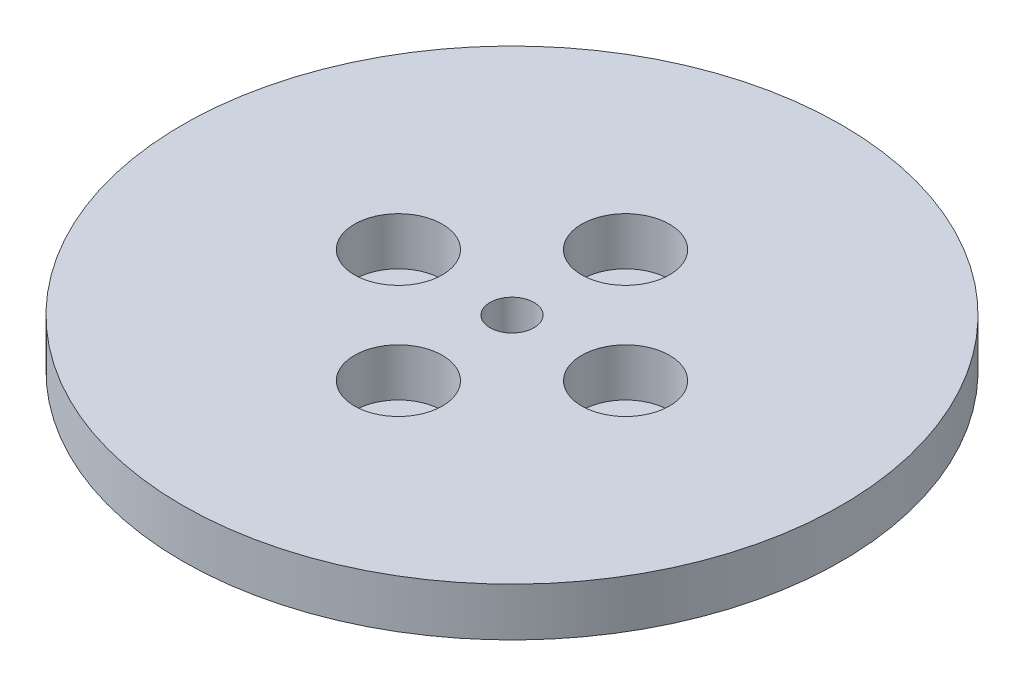
ISO-10303-21;
HEADER;
FILE_DESCRIPTION(('STEP AP214'),'2;1');
FILE_NAME('part.step','',(''),(''),'','','');
FILE_SCHEMA(('AUTOMOTIVE_DESIGN { 1 0 10303 214 1 1 1 1 }'));
ENDSEC;
DATA;
#1=APPLICATION_CONTEXT('core data for automotive mechanical design processes');
#2=APPLICATION_PROTOCOL_DEFINITION('international standard','automotive_design',2000,#1);
#3=PRODUCT_CONTEXT('',#1,'mechanical');
#4=PRODUCT('Part','Part','',(#3));
#5=PRODUCT_RELATED_PRODUCT_CATEGORY('part','',(#4));
#6=PRODUCT_DEFINITION_FORMATION('','',#4);
#7=PRODUCT_DEFINITION_CONTEXT('part definition',#1,'design');
#8=PRODUCT_DEFINITION('design','',#6,#7);
#9=PRODUCT_DEFINITION_SHAPE('','',#8);
#10=(LENGTH_UNIT() NAMED_UNIT(*) SI_UNIT(.MILLI.,.METRE.));
#11=(NAMED_UNIT(*) PLANE_ANGLE_UNIT() SI_UNIT($,.RADIAN.));
#12=(NAMED_UNIT(*) SI_UNIT($,.STERADIAN.) SOLID_ANGLE_UNIT());
#13=UNCERTAINTY_MEASURE_WITH_UNIT(LENGTH_MEASURE(1.E-05),#10,'distance_accuracy_value','');
#14=(GEOMETRIC_REPRESENTATION_CONTEXT(3) GLOBAL_UNCERTAINTY_ASSIGNED_CONTEXT((#13)) GLOBAL_UNIT_ASSIGNED_CONTEXT((#10,
#11,#12)) REPRESENTATION_CONTEXT('',''));
#15=CARTESIAN_POINT('',(0.,0.,0.));
#16=DIRECTION('',(0.,0.,1.));
#17=DIRECTION('',(1.,0.,0.));
#18=AXIS2_PLACEMENT_3D('',#15,#16,#17);
#19=CARTESIAN_POINT('',(0.,11.,0.));
#20=DIRECTION('',(0.,-1.,0.));
#21=DIRECTION('',(0.,0.,-1.));
#22=AXIS2_PLACEMENT_3D('',#19,#20,#21);
#23=CYLINDRICAL_SURFACE('',#22,75.);
#24=CARTESIAN_POINT('',(0.,11.,0.));
#25=DIRECTION('',(0.,1.,0.));
#26=DIRECTION('',(0.,0.,1.));
#27=AXIS2_PLACEMENT_3D('',#24,#25,#26);
#28=CIRCLE('',#27,75.);
#29=CARTESIAN_POINT('',(0.,11.,75.));
#30=VERTEX_POINT('',#29);
#31=EDGE_CURVE('E10',#30,#30,#28,.T.);
#32=ORIENTED_EDGE('',*,*,#31,.F.);
#33=EDGE_LOOP('',(#32));
#34=FACE_BOUND('',#33,.T.);
#35=CARTESIAN_POINT('',(0.,0.,0.));
#36=DIRECTION('',(0.,1.,0.));
#37=DIRECTION('',(0.,0.,1.));
#38=AXIS2_PLACEMENT_3D('',#35,#36,#37);
#39=CIRCLE('',#38,75.);
#40=CARTESIAN_POINT('',(0.,0.,75.));
#41=VERTEX_POINT('',#40);
#42=EDGE_CURVE('E37',#41,#41,#39,.T.);
#43=ORIENTED_EDGE('',*,*,#42,.T.);
#44=EDGE_LOOP('',(#43));
#45=FACE_BOUND('',#44,.T.);
#46=ADVANCED_FACE('F40',(#34,#45),#23,.T.);
#47=CARTESIAN_POINT('',(0.,11.,0.));
#48=DIRECTION('',(0.,1.,0.));
#49=DIRECTION('',(0.,0.,1.));
#50=AXIS2_PLACEMENT_3D('',#47,#48,#49);
#51=PLANE('',#50);
#52=CARTESIAN_POINT('',(0.,11.,25.8487012314361));
#53=DIRECTION('',(0.,1.,0.));
#54=DIRECTION('',(1.,0.,0.));
#55=AXIS2_PLACEMENT_3D('',#52,#53,#54);
#56=CIRCLE('',#55,10.);
#57=CARTESIAN_POINT('',(10.0000000000001,11.,25.848701231436));
#58=VERTEX_POINT('',#57);
#59=EDGE_CURVE('E71',#58,#58,#56,.T.);
#60=ORIENTED_EDGE('',*,*,#59,.F.);
#61=EDGE_LOOP('',(#60));
#62=FACE_BOUND('',#61,.T.);
#63=CARTESIAN_POINT('',(25.8487012314361,11.,0.));
#64=DIRECTION('',(0.,1.,0.));
#65=DIRECTION('',(0.,0.,-1.));
#66=AXIS2_PLACEMENT_3D('',#63,#64,#65);
#67=CIRCLE('',#66,10.);
#68=CARTESIAN_POINT('',(25.8487012314361,11.,-10.));
#69=VERTEX_POINT('',#68);
#70=EDGE_CURVE('E70',#69,#69,#67,.T.);
#71=ORIENTED_EDGE('',*,*,#70,.F.);
#72=EDGE_LOOP('',(#71));
#73=FACE_BOUND('',#72,.T.);
#74=CARTESIAN_POINT('',(-2.70750773948672E-13,11.,-25.8487012314361));
#75=DIRECTION('',(0.,1.,0.));
#76=DIRECTION('',(-1.,0.,0.));
#77=AXIS2_PLACEMENT_3D('',#74,#75,#76);
#78=CIRCLE('',#77,10.);
#79=CARTESIAN_POINT('',(-10.0000000000003,11.,-25.848701231436));
#80=VERTEX_POINT('',#79);
#81=EDGE_CURVE('E61',#80,#80,#78,.T.);
#82=ORIENTED_EDGE('',*,*,#81,.F.);
#83=EDGE_LOOP('',(#82));
#84=FACE_BOUND('',#83,.T.);
#85=CARTESIAN_POINT('',(-25.8487012314361,11.,0.));
#86=DIRECTION('',(0.,1.,0.));
#87=DIRECTION('',(0.,0.,1.));
#88=AXIS2_PLACEMENT_3D('',#85,#86,#87);
#89=CIRCLE('',#88,10.);
#90=CARTESIAN_POINT('',(-25.8487012314361,11.,10.));
#91=VERTEX_POINT('',#90);
#92=EDGE_CURVE('E54',#91,#91,#89,.T.);
#93=ORIENTED_EDGE('',*,*,#92,.F.);
#94=EDGE_LOOP('',(#93));
#95=FACE_BOUND('',#94,.T.);
#96=CARTESIAN_POINT('',(0.,11.,0.));
#97=DIRECTION('',(0.,1.,0.));
#98=DIRECTION('',(0.,0.,1.));
#99=AXIS2_PLACEMENT_3D('',#96,#97,#98);
#100=CIRCLE('',#99,5.);
#101=CARTESIAN_POINT('',(0.,11.,5.));
#102=VERTEX_POINT('',#101);
#103=EDGE_CURVE('E50',#102,#102,#100,.T.);
#104=ORIENTED_EDGE('',*,*,#103,.F.);
#105=EDGE_LOOP('',(#104));
#106=FACE_BOUND('',#105,.T.);
#107=ORIENTED_EDGE('',*,*,#31,.T.);
#108=EDGE_LOOP('',(#107));
#109=FACE_BOUND('',#108,.T.);
#110=ADVANCED_FACE('F86',(#62,#73,#84,#95,#106,#109),#51,.T.);
#111=CARTESIAN_POINT('',(0.,0.,0.));
#112=DIRECTION('',(0.,1.,0.));
#113=DIRECTION('',(0.,0.,1.));
#114=AXIS2_PLACEMENT_3D('',#111,#112,#113);
#115=PLANE('',#114);
#116=CARTESIAN_POINT('',(0.,0.,0.));
#117=DIRECTION('',(0.,1.,0.));
#118=DIRECTION('',(0.,0.,1.));
#119=AXIS2_PLACEMENT_3D('',#116,#117,#118);
#120=CIRCLE('',#119,5.);
#121=CARTESIAN_POINT('',(0.,0.,5.));
#122=VERTEX_POINT('',#121);
#123=EDGE_CURVE('E47',#122,#122,#120,.T.);
#124=ORIENTED_EDGE('',*,*,#123,.T.);
#125=EDGE_LOOP('',(#124));
#126=FACE_BOUND('',#125,.T.);
#127=ORIENTED_EDGE('',*,*,#42,.F.);
#128=EDGE_LOOP('',(#127));
#129=FACE_BOUND('',#128,.T.);
#130=ADVANCED_FACE('F93',(#126,#129),#115,.F.);
#131=CARTESIAN_POINT('',(0.,11.,0.));
#132=DIRECTION('',(0.,-1.,0.));
#133=DIRECTION('',(0.,0.,-1.));
#134=AXIS2_PLACEMENT_3D('',#131,#132,#133);
#135=CYLINDRICAL_SURFACE('',#134,5.);
#136=ORIENTED_EDGE('',*,*,#103,.T.);
#137=EDGE_LOOP('',(#136));
#138=FACE_BOUND('',#137,.T.);
#139=ORIENTED_EDGE('',*,*,#123,.F.);
#140=EDGE_LOOP('',(#139));
#141=FACE_BOUND('',#140,.T.);
#142=ADVANCED_FACE('F101',(#138,#141),#135,.F.);
#143=CARTESIAN_POINT('',(-25.8487012314361,0.126823534459064,0.));
#144=DIRECTION('',(0.,1.,0.));
#145=DIRECTION('',(0.,0.,1.));
#146=AXIS2_PLACEMENT_3D('',#143,#144,#145);
#147=CYLINDRICAL_SURFACE('',#146,10.);
#148=CARTESIAN_POINT('',(-25.8487012314361,0.126823534459064,0.));
#149=DIRECTION('',(0.,1.,0.));
#150=DIRECTION('',(0.,0.,1.));
#151=AXIS2_PLACEMENT_3D('',#148,#149,#150);
#152=CIRCLE('',#151,10.);
#153=CARTESIAN_POINT('',(-25.8487012314361,0.126823534459064,10.));
#154=VERTEX_POINT('',#153);
#155=EDGE_CURVE('E55',#154,#154,#152,.T.);
#156=ORIENTED_EDGE('',*,*,#155,.F.);
#157=EDGE_LOOP('',(#156));
#158=FACE_BOUND('',#157,.T.);
#159=ORIENTED_EDGE('',*,*,#92,.T.);
#160=EDGE_LOOP('',(#159));
#161=FACE_BOUND('',#160,.T.);
#162=ADVANCED_FACE('F102',(#158,#161),#147,.F.);
#163=CARTESIAN_POINT('',(-25.8487012314361,0.126823534459064,0.));
#164=DIRECTION('',(0.,1.,0.));
#165=DIRECTION('',(0.,0.,1.));
#166=AXIS2_PLACEMENT_3D('',#163,#164,#165);
#167=PLANE('',#166);
#168=ORIENTED_EDGE('',*,*,#155,.T.);
#169=EDGE_LOOP('',(#168));
#170=FACE_BOUND('',#169,.T.);
#171=ADVANCED_FACE('F133',(#170),#167,.T.);
#172=CARTESIAN_POINT('',(-2.70750773948672E-13,0.126823534459064,-25.8487012314361));
#173=DIRECTION('',(0.,1.,0.));
#174=DIRECTION('',(0.,0.,1.));
#175=AXIS2_PLACEMENT_3D('',#172,#173,#174);
#176=CYLINDRICAL_SURFACE('',#175,10.);
#177=CARTESIAN_POINT('',(-2.70750773948672E-13,0.126823534459064,-25.8487012314361));
#178=DIRECTION('',(0.,1.,0.));
#179=DIRECTION('',(-1.,0.,0.));
#180=AXIS2_PLACEMENT_3D('',#177,#178,#179);
#181=CIRCLE('',#180,10.);
#182=CARTESIAN_POINT('',(-10.0000000000003,0.126823534459064,-25.848701231436));
#183=VERTEX_POINT('',#182);
#184=EDGE_CURVE('E63',#183,#183,#181,.T.);
#185=ORIENTED_EDGE('',*,*,#184,.F.);
#186=EDGE_LOOP('',(#185));
#187=FACE_BOUND('',#186,.T.);
#188=ORIENTED_EDGE('',*,*,#81,.T.);
#189=EDGE_LOOP('',(#188));
#190=FACE_BOUND('',#189,.T.);
#191=ADVANCED_FACE('F142',(#187,#190),#176,.F.);
#192=CARTESIAN_POINT('',(-2.70750773948672E-13,0.126823534459064,-25.8487012314361));
#193=DIRECTION('',(0.,1.,0.));
#194=DIRECTION('',(-1.,0.,0.));
#195=AXIS2_PLACEMENT_3D('',#192,#193,#194);
#196=PLANE('',#195);
#197=ORIENTED_EDGE('',*,*,#184,.T.);
#198=EDGE_LOOP('',(#197));
#199=FACE_BOUND('',#198,.T.);
#200=ADVANCED_FACE('F156',(#199),#196,.T.);
#201=CARTESIAN_POINT('',(25.8487012314361,0.126823534459064,0.));
#202=DIRECTION('',(0.,1.,0.));
#203=DIRECTION('',(0.,0.,1.));
#204=AXIS2_PLACEMENT_3D('',#201,#202,#203);
#205=CYLINDRICAL_SURFACE('',#204,10.);
#206=CARTESIAN_POINT('',(25.8487012314361,0.126823534459064,0.));
#207=DIRECTION('',(0.,1.,0.));
#208=DIRECTION('',(0.,0.,-1.));
#209=AXIS2_PLACEMENT_3D('',#206,#207,#208);
#210=CIRCLE('',#209,10.);
#211=CARTESIAN_POINT('',(25.8487012314361,0.126823534459064,-10.));
#212=VERTEX_POINT('',#211);
#213=EDGE_CURVE('E69',#212,#212,#210,.T.);
#214=ORIENTED_EDGE('',*,*,#213,.F.);
#215=EDGE_LOOP('',(#214));
#216=FACE_BOUND('',#215,.T.);
#217=ORIENTED_EDGE('',*,*,#70,.T.);
#218=EDGE_LOOP('',(#217));
#219=FACE_BOUND('',#218,.T.);
#220=ADVANCED_FACE('F164',(#216,#219),#205,.F.);
#221=CARTESIAN_POINT('',(25.8487012314361,0.126823534459064,0.));
#222=DIRECTION('',(0.,1.,0.));
#223=DIRECTION('',(0.,0.,-1.));
#224=AXIS2_PLACEMENT_3D('',#221,#222,#223);
#225=PLANE('',#224);
#226=ORIENTED_EDGE('',*,*,#213,.T.);
#227=EDGE_LOOP('',(#226));
#228=FACE_BOUND('',#227,.T.);
#229=ADVANCED_FACE('F83',(#228),#225,.T.);
#230=CARTESIAN_POINT('',(0.,0.126823534459064,25.8487012314361));
#231=DIRECTION('',(0.,1.,0.));
#232=DIRECTION('',(0.,0.,1.));
#233=AXIS2_PLACEMENT_3D('',#230,#231,#232);
#234=CYLINDRICAL_SURFACE('',#233,10.);
#235=CARTESIAN_POINT('',(0.,0.126823534459064,25.8487012314361));
#236=DIRECTION('',(0.,1.,0.));
#237=DIRECTION('',(1.,0.,0.));
#238=AXIS2_PLACEMENT_3D('',#235,#236,#237);
#239=CIRCLE('',#238,10.);
#240=CARTESIAN_POINT('',(10.0000000000001,0.126823534459064,25.848701231436));
#241=VERTEX_POINT('',#240);
#242=EDGE_CURVE('E59',#241,#241,#239,.T.);
#243=ORIENTED_EDGE('',*,*,#242,.F.);
#244=EDGE_LOOP('',(#243));
#245=FACE_BOUND('',#244,.T.);
#246=ORIENTED_EDGE('',*,*,#59,.T.);
#247=EDGE_LOOP('',(#246));
#248=FACE_BOUND('',#247,.T.);
#249=ADVANCED_FACE('F81',(#245,#248),#234,.F.);
#250=CARTESIAN_POINT('',(0.,0.126823534459064,25.8487012314361));
#251=DIRECTION('',(0.,1.,0.));
#252=DIRECTION('',(1.,0.,0.));
#253=AXIS2_PLACEMENT_3D('',#250,#251,#252);
#254=PLANE('',#253);
#255=ORIENTED_EDGE('',*,*,#242,.T.);
#256=EDGE_LOOP('',(#255));
#257=FACE_BOUND('',#256,.T.);
#258=ADVANCED_FACE('F78',(#257),#254,.T.);
#259=CLOSED_SHELL('',(#46,#110,#130,#142,#162,#171,#191,#200,#220,#229,#249,#258));
#260=MANIFOLD_SOLID_BREP('B2',#259);
#261=ADVANCED_BREP_SHAPE_REPRESENTATION('',(#18,#260),#14);
#262=SHAPE_DEFINITION_REPRESENTATION(#9,#261);
ENDSEC;
END-ISO-10303-21;
